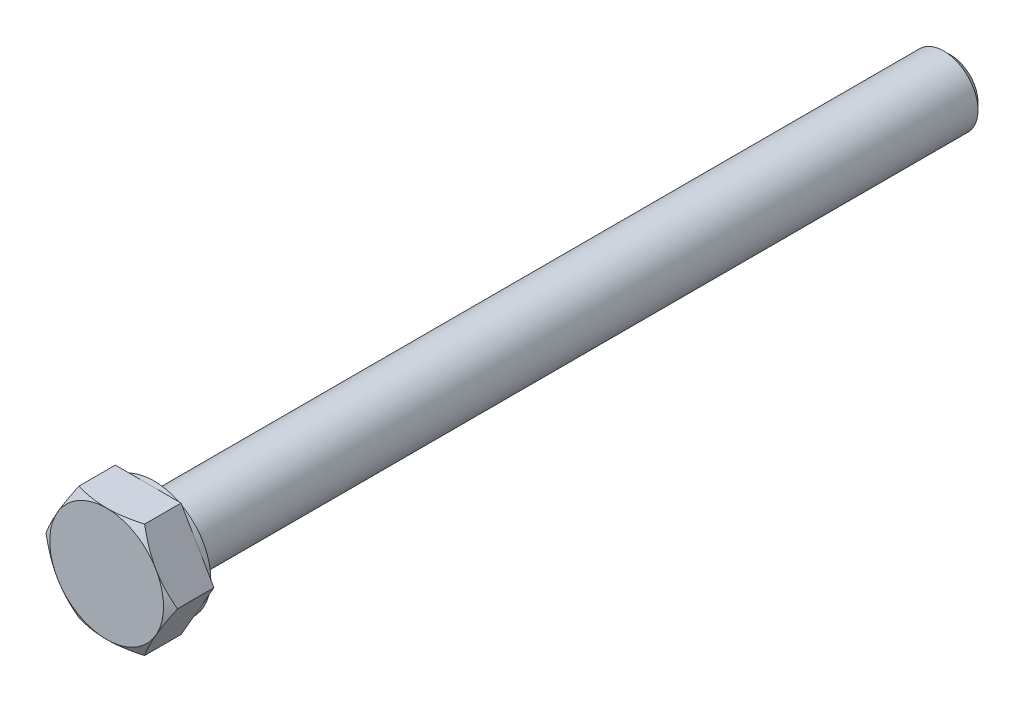
ISO-10303-21;
HEADER;
FILE_DESCRIPTION(('STEP AP214'),'2;1');
FILE_NAME('part.step','',(''),(''),'','','');
FILE_SCHEMA(('AUTOMOTIVE_DESIGN { 1 0 10303 214 1 1 1 1 }'));
ENDSEC;
DATA;
#1=APPLICATION_CONTEXT('core data for automotive mechanical design processes');
#2=APPLICATION_PROTOCOL_DEFINITION('international standard','automotive_design',2000,#1);
#3=PRODUCT_CONTEXT('',#1,'mechanical');
#4=PRODUCT('Part','Part','',(#3));
#5=PRODUCT_RELATED_PRODUCT_CATEGORY('part','',(#4));
#6=PRODUCT_DEFINITION_FORMATION('','',#4);
#7=PRODUCT_DEFINITION_CONTEXT('part definition',#1,'design');
#8=PRODUCT_DEFINITION('design','',#6,#7);
#9=PRODUCT_DEFINITION_SHAPE('','',#8);
#10=(LENGTH_UNIT() NAMED_UNIT(*) SI_UNIT(.MILLI.,.METRE.));
#11=(NAMED_UNIT(*) PLANE_ANGLE_UNIT() SI_UNIT($,.RADIAN.));
#12=(NAMED_UNIT(*) SI_UNIT($,.STERADIAN.) SOLID_ANGLE_UNIT());
#13=UNCERTAINTY_MEASURE_WITH_UNIT(LENGTH_MEASURE(1.E-05),#10,'distance_accuracy_value','');
#14=(GEOMETRIC_REPRESENTATION_CONTEXT(3) GLOBAL_UNCERTAINTY_ASSIGNED_CONTEXT((#13)) GLOBAL_UNIT_ASSIGNED_CONTEXT((#10,
#11,#12)) REPRESENTATION_CONTEXT('',''));
#15=CARTESIAN_POINT('',(0.,0.,0.));
#16=DIRECTION('',(0.,0.,1.));
#17=DIRECTION('',(1.,0.,0.));
#18=AXIS2_PLACEMENT_3D('',#15,#16,#17);
#19=CARTESIAN_POINT('',(0.,0.,4.15));
#20=DIRECTION('',(0.,0.,1.));
#21=DIRECTION('',(1.,0.,0.));
#22=AXIS2_PLACEMENT_3D('',#19,#20,#21);
#23=PLANE('',#22);
#24=CARTESIAN_POINT('',(0.,0.,4.15));
#25=DIRECTION('',(0.,0.,1.));
#26=DIRECTION('',(1.,0.,0.));
#27=AXIS2_PLACEMENT_3D('',#24,#25,#26);
#28=CIRCLE('',#27,5.);
#29=CARTESIAN_POINT('',(5.,0.,4.15));
#30=VERTEX_POINT('',#29);
#31=EDGE_CURVE('E10',#30,#30,#28,.T.);
#32=ORIENTED_EDGE('',*,*,#31,.T.);
#33=EDGE_LOOP('',(#32));
#34=FACE_BOUND('',#33,.T.);
#35=ADVANCED_FACE('F16',(#34),#23,.T.);
#36=CARTESIAN_POINT('',(0.,0.,4.15));
#37=DIRECTION('',(0.,0.,-1.));
#38=DIRECTION('',(1.,0.,0.));
#39=AXIS2_PLACEMENT_3D('',#36,#37,#38);
#40=CONICAL_SURFACE('',#39,5.,1.047197551197);
#41=CARTESIAN_POINT('',(2.8874999999992,5.00129670685568,3.70255354137743));
#42=CARTESIAN_POINT('',(4.33124999999986,2.50064835342825,4.53610299252072));
#43=CARTESIAN_POINT('',(5.77500000000043,9.62341317745086E-13,3.70255354137764));
#44=(BOUNDED_CURVE() B_SPLINE_CURVE(2,(#41,#42,#43),.UNSPECIFIED.,.F.,
.F.) B_SPLINE_CURVE_WITH_KNOTS((3,3),(0.,1.),
.UNSPECIFIED.) CURVE() GEOMETRIC_REPRESENTATION_ITEM() RATIONAL_B_SPLINE_CURVE((1.,
1.15470053837938,1.)) REPRESENTATION_ITEM(''));
#45=CARTESIAN_POINT('',(2.8875,5.001296706855,3.702553541378));
#46=VERTEX_POINT('',#45);
#47=CARTESIAN_POINT('',(5.775,0.,3.702553541378));
#48=VERTEX_POINT('',#47);
#49=EDGE_CURVE('E135',#46,#48,#44,.T.);
#50=ORIENTED_EDGE('',*,*,#49,.F.);
#51=CARTESIAN_POINT('',(-2.88750000000039,5.001296706855,3.70255354137778));
#52=CARTESIAN_POINT('',(-1.94066984704477E-13,5.00129670685504,4.53610299252048));
#53=CARTESIAN_POINT('',(2.88749999999987,5.001296706855,3.70255354137793));
#54=(BOUNDED_CURVE() B_SPLINE_CURVE(2,(#51,#52,#53),.UNSPECIFIED.,.F.,
.F.) B_SPLINE_CURVE_WITH_KNOTS((3,3),(0.,1.),
.UNSPECIFIED.) CURVE() GEOMETRIC_REPRESENTATION_ITEM() RATIONAL_B_SPLINE_CURVE((1.,
1.15470053837927,1.)) REPRESENTATION_ITEM(''));
#55=CARTESIAN_POINT('',(-2.8875,5.001296706855,3.702553541378));
#56=VERTEX_POINT('',#55);
#57=EDGE_CURVE('E155',#56,#46,#54,.T.);
#58=ORIENTED_EDGE('',*,*,#57,.F.);
#59=CARTESIAN_POINT('',(-5.7750000000016,-1.0627054791712E-12,3.70255354137697));
#60=CARTESIAN_POINT('',(-4.33125000000055,2.50064835342705,4.53610299252083));
#61=CARTESIAN_POINT('',(-2.88749999999986,5.00129670685454,3.70255354137781));
#62=(BOUNDED_CURVE() B_SPLINE_CURVE(2,(#59,#60,#61),.UNSPECIFIED.,.F.,
.F.) B_SPLINE_CURVE_WITH_KNOTS((3,3),(0.,1.),
.UNSPECIFIED.) CURVE() GEOMETRIC_REPRESENTATION_ITEM() RATIONAL_B_SPLINE_CURVE((1.,
1.15470053837943,1.)) REPRESENTATION_ITEM(''));
#63=CARTESIAN_POINT('',(-5.775,0.,3.702553541378));
#64=VERTEX_POINT('',#63);
#65=EDGE_CURVE('E161',#64,#56,#62,.T.);
#66=ORIENTED_EDGE('',*,*,#65,.F.);
#67=CARTESIAN_POINT('',(-2.8874999999992,-5.00129670685568,3.70255354137743));
#68=CARTESIAN_POINT('',(-4.33124999999987,-2.50064835342823,4.53610299252073));
#69=CARTESIAN_POINT('',(-5.77500000000045,-9.2104102122903E-13,3.70255354137763));
#70=(BOUNDED_CURVE() B_SPLINE_CURVE(2,(#67,#68,#69),.UNSPECIFIED.,.F.,
.F.) B_SPLINE_CURVE_WITH_KNOTS((3,3),(0.,1.),
.UNSPECIFIED.) CURVE() GEOMETRIC_REPRESENTATION_ITEM() RATIONAL_B_SPLINE_CURVE((1.,
1.15470053837938,1.)) REPRESENTATION_ITEM(''));
#71=CARTESIAN_POINT('',(-2.8875,-5.001296706855,3.702553541378));
#72=VERTEX_POINT('',#71);
#73=EDGE_CURVE('E176',#72,#64,#70,.T.);
#74=ORIENTED_EDGE('',*,*,#73,.F.);
#75=CARTESIAN_POINT('',(2.88750000000039,-5.001296706855,3.70255354137778));
#76=CARTESIAN_POINT('',(1.93622895494628E-13,-5.00129670685504,4.53610299252048));
#77=CARTESIAN_POINT('',(-2.88749999999987,-5.001296706855,3.70255354137793));
#78=(BOUNDED_CURVE() B_SPLINE_CURVE(2,(#75,#76,#77),.UNSPECIFIED.,.F.,
.F.) B_SPLINE_CURVE_WITH_KNOTS((3,3),(0.,1.),
.UNSPECIFIED.) CURVE() GEOMETRIC_REPRESENTATION_ITEM() RATIONAL_B_SPLINE_CURVE((1.,
1.15470053837927,1.)) REPRESENTATION_ITEM(''));
#79=CARTESIAN_POINT('',(2.8875,-5.001296706855,3.702553541378));
#80=VERTEX_POINT('',#79);
#81=EDGE_CURVE('E188',#80,#72,#78,.T.);
#82=ORIENTED_EDGE('',*,*,#81,.F.);
#83=CARTESIAN_POINT('',(5.77500000000167,1.18571819029967E-12,3.70255354137693));
#84=CARTESIAN_POINT('',(4.33125000000057,-2.50064835342701,4.53610299252084));
#85=CARTESIAN_POINT('',(2.88749999999986,-5.00129670685454,3.70255354137781));
#86=(BOUNDED_CURVE() B_SPLINE_CURVE(2,(#83,#84,#85),.UNSPECIFIED.,.F.,
.F.) B_SPLINE_CURVE_WITH_KNOTS((3,3),(0.,1.),
.UNSPECIFIED.) CURVE() GEOMETRIC_REPRESENTATION_ITEM() RATIONAL_B_SPLINE_CURVE((1.,
1.15470053837944,1.)) REPRESENTATION_ITEM(''));
#87=EDGE_CURVE('E41',#48,#80,#86,.T.);
#88=ORIENTED_EDGE('',*,*,#87,.F.);
#89=DIRECTION('',(0.866025403784329,0.,-0.50000000000019));
#90=VECTOR('',#89,1.);
#91=CARTESIAN_POINT('',(5.,0.,4.15));
#92=LINE('',#91,#90);
#93=EDGE_CURVE('E24',#30,#48,#92,.T.);
#94=ORIENTED_EDGE('',*,*,#93,.F.);
#95=ORIENTED_EDGE('',*,*,#31,.F.);
#96=ORIENTED_EDGE('',*,*,#93,.T.);
#97=EDGE_LOOP('',(#50,#58,#66,#74,#82,#88,#94,#95,#96));
#98=FACE_BOUND('',#97,.T.);
#99=ADVANCED_FACE('F207',(#98),#40,.T.);
#100=CARTESIAN_POINT('',(2.8875,-5.001296706855,0.));
#101=DIRECTION('',(-0.866025403784329,0.50000000000019,0.));
#102=DIRECTION('',(0.,0.,1.));
#103=AXIS2_PLACEMENT_3D('',#100,#101,#102);
#104=PLANE('',#103);
#105=DIRECTION('',(0.,0.,1.));
#106=VECTOR('',#105,1.);
#107=CARTESIAN_POINT('',(5.775,0.,0.5));
#108=LINE('',#107,#106);
#109=CARTESIAN_POINT('',(5.775,0.,0.5));
#110=VERTEX_POINT('',#109);
#111=EDGE_CURVE('E148',#110,#48,#108,.T.);
#112=ORIENTED_EDGE('',*,*,#111,.T.);
#113=ORIENTED_EDGE('',*,*,#87,.T.);
#114=DIRECTION('',(0.,0.,1.));
#115=VECTOR('',#114,1.);
#116=CARTESIAN_POINT('',(2.8875,-5.001296706855,0.));
#117=LINE('',#116,#115);
#118=CARTESIAN_POINT('',(2.8875,-5.001296706855,0.5));
#119=VERTEX_POINT('',#118);
#120=EDGE_CURVE('E181',#119,#80,#117,.T.);
#121=ORIENTED_EDGE('',*,*,#120,.F.);
#122=DIRECTION('',(0.50000000000019,0.866025403784329,0.));
#123=VECTOR('',#122,1.);
#124=CARTESIAN_POINT('',(3.609375,-3.750972530141,0.5));
#125=LINE('',#124,#123);
#126=EDGE_CURVE('E121',#119,#110,#125,.T.);
#127=ORIENTED_EDGE('',*,*,#126,.T.);
#128=EDGE_LOOP('',(#112,#113,#121,#127));
#129=FACE_BOUND('',#128,.T.);
#130=ADVANCED_FACE('F211',(#129),#104,.F.);
#131=CARTESIAN_POINT('',(-2.8875,-5.001296706855,0.));
#132=DIRECTION('',(0.,1.,0.));
#133=DIRECTION('',(1.,0.,0.));
#134=AXIS2_PLACEMENT_3D('',#131,#132,#133);
#135=PLANE('',#134);
#136=ORIENTED_EDGE('',*,*,#120,.T.);
#137=ORIENTED_EDGE('',*,*,#81,.T.);
#138=DIRECTION('',(0.,0.,1.));
#139=VECTOR('',#138,1.);
#140=CARTESIAN_POINT('',(-2.8875,-5.001296706855,0.));
#141=LINE('',#140,#139);
#142=CARTESIAN_POINT('',(-2.8875,-5.001296706855,0.5));
#143=VERTEX_POINT('',#142);
#144=EDGE_CURVE('E169',#143,#72,#141,.T.);
#145=ORIENTED_EDGE('',*,*,#144,.F.);
#146=DIRECTION('',(1.,0.,0.));
#147=VECTOR('',#146,1.);
#148=CARTESIAN_POINT('',(-1.44375,-5.001296706855,0.5));
#149=LINE('',#148,#147);
#150=EDGE_CURVE('E130',#143,#119,#149,.T.);
#151=ORIENTED_EDGE('',*,*,#150,.T.);
#152=EDGE_LOOP('',(#136,#137,#145,#151));
#153=FACE_BOUND('',#152,.T.);
#154=ADVANCED_FACE('F275',(#153),#135,.F.);
#155=CARTESIAN_POINT('',(-5.775,0.,0.));
#156=DIRECTION('',(0.866025403784329,0.50000000000019,0.));
#157=DIRECTION('',(0.,0.,-1.));
#158=AXIS2_PLACEMENT_3D('',#155,#156,#157);
#159=PLANE('',#158);
#160=ORIENTED_EDGE('',*,*,#144,.T.);
#161=ORIENTED_EDGE('',*,*,#73,.T.);
#162=DIRECTION('',(0.,0.,1.));
#163=VECTOR('',#162,1.);
#164=CARTESIAN_POINT('',(-5.775,0.,0.));
#165=LINE('',#164,#163);
#166=CARTESIAN_POINT('',(-5.775,0.,0.5));
#167=VERTEX_POINT('',#166);
#168=EDGE_CURVE('E160',#167,#64,#165,.T.);
#169=ORIENTED_EDGE('',*,*,#168,.F.);
#170=DIRECTION('',(0.50000000000019,-0.866025403784329,0.));
#171=VECTOR('',#170,1.);
#172=CARTESIAN_POINT('',(-5.053125,-1.250324176714,0.5));
#173=LINE('',#172,#171);
#174=EDGE_CURVE('E140',#167,#143,#173,.T.);
#175=ORIENTED_EDGE('',*,*,#174,.T.);
#176=EDGE_LOOP('',(#160,#161,#169,#175));
#177=FACE_BOUND('',#176,.T.);
#178=ADVANCED_FACE('F284',(#177),#159,.F.);
#179=CARTESIAN_POINT('',(-2.8875,5.001296706855,0.));
#180=DIRECTION('',(0.866025403784329,-0.50000000000019,0.));
#181=DIRECTION('',(0.,0.,-1.));
#182=AXIS2_PLACEMENT_3D('',#179,#180,#181);
#183=PLANE('',#182);
#184=ORIENTED_EDGE('',*,*,#168,.T.);
#185=ORIENTED_EDGE('',*,*,#65,.T.);
#186=DIRECTION('',(0.,0.,1.));
#187=VECTOR('',#186,1.);
#188=CARTESIAN_POINT('',(-2.8875,5.001296706855,0.));
#189=LINE('',#188,#187);
#190=CARTESIAN_POINT('',(-2.8875,5.001296706855,0.5));
#191=VERTEX_POINT('',#190);
#192=EDGE_CURVE('E151',#191,#56,#189,.T.);
#193=ORIENTED_EDGE('',*,*,#192,.F.);
#194=DIRECTION('',(-0.50000000000019,-0.866025403784329,0.));
#195=VECTOR('',#194,1.);
#196=CARTESIAN_POINT('',(-3.609375,3.750972530141,0.5));
#197=LINE('',#196,#195);
#198=EDGE_CURVE('E144',#191,#167,#197,.T.);
#199=ORIENTED_EDGE('',*,*,#198,.T.);
#200=EDGE_LOOP('',(#184,#185,#193,#199));
#201=FACE_BOUND('',#200,.T.);
#202=ADVANCED_FACE('F287',(#201),#183,.F.);
#203=CARTESIAN_POINT('',(2.8875,5.001296706855,0.));
#204=DIRECTION('',(0.,-1.,0.));
#205=DIRECTION('',(-1.,0.,0.));
#206=AXIS2_PLACEMENT_3D('',#203,#204,#205);
#207=PLANE('',#206);
#208=ORIENTED_EDGE('',*,*,#192,.T.);
#209=ORIENTED_EDGE('',*,*,#57,.T.);
#210=DIRECTION('',(0.,0.,1.));
#211=VECTOR('',#210,1.);
#212=CARTESIAN_POINT('',(2.8875,5.001296706855,0.));
#213=LINE('',#212,#211);
#214=CARTESIAN_POINT('',(2.8875,5.001296706855,0.5));
#215=VERTEX_POINT('',#214);
#216=EDGE_CURVE('E131',#215,#46,#213,.T.);
#217=ORIENTED_EDGE('',*,*,#216,.F.);
#218=DIRECTION('',(-1.,0.,0.));
#219=VECTOR('',#218,1.);
#220=CARTESIAN_POINT('',(1.44375,5.001296706855,0.5));
#221=LINE('',#220,#219);
#222=EDGE_CURVE('E136',#215,#191,#221,.T.);
#223=ORIENTED_EDGE('',*,*,#222,.T.);
#224=EDGE_LOOP('',(#208,#209,#217,#223));
#225=FACE_BOUND('',#224,.T.);
#226=ADVANCED_FACE('F281',(#225),#207,.F.);
#227=CARTESIAN_POINT('',(5.775,0.,0.));
#228=DIRECTION('',(-0.866025403784329,-0.50000000000019,0.));
#229=DIRECTION('',(-0.50000000000019,0.866025403784329,0.));
#230=AXIS2_PLACEMENT_3D('',#227,#228,#229);
#231=PLANE('',#230);
#232=ORIENTED_EDGE('',*,*,#216,.T.);
#233=ORIENTED_EDGE('',*,*,#49,.T.);
#234=ORIENTED_EDGE('',*,*,#111,.F.);
#235=DIRECTION('',(-0.50000000000019,0.866025403784329,0.));
#236=VECTOR('',#235,1.);
#237=CARTESIAN_POINT('',(5.053125,1.250324176714,0.5));
#238=LINE('',#237,#236);
#239=EDGE_CURVE('E114',#110,#215,#238,.T.);
#240=ORIENTED_EDGE('',*,*,#239,.T.);
#241=EDGE_LOOP('',(#232,#233,#234,#240));
#242=FACE_BOUND('',#241,.T.);
#243=ADVANCED_FACE('F215',(#242),#231,.F.);
#244=CARTESIAN_POINT('',(0.,0.,0.5));
#245=DIRECTION('',(0.,0.,1.));
#246=DIRECTION('',(1.,0.,0.));
#247=AXIS2_PLACEMENT_3D('',#244,#245,#246);
#248=PLANE('',#247);
#249=CARTESIAN_POINT('',(0.,0.,0.5));
#250=DIRECTION('',(0.,0.,1.));
#251=DIRECTION('',(1.,0.,0.));
#252=AXIS2_PLACEMENT_3D('',#249,#250,#251);
#253=CIRCLE('',#252,5.);
#254=CARTESIAN_POINT('',(5.,0.,0.5));
#255=VERTEX_POINT('',#254);
#256=EDGE_CURVE('E108',#255,#255,#253,.T.);
#257=ORIENTED_EDGE('',*,*,#256,.T.);
#258=EDGE_LOOP('',(#257));
#259=FACE_BOUND('',#258,.T.);
#260=ORIENTED_EDGE('',*,*,#239,.F.);
#261=ORIENTED_EDGE('',*,*,#126,.F.);
#262=ORIENTED_EDGE('',*,*,#150,.F.);
#263=ORIENTED_EDGE('',*,*,#174,.F.);
#264=ORIENTED_EDGE('',*,*,#198,.F.);
#265=ORIENTED_EDGE('',*,*,#222,.F.);
#266=EDGE_LOOP('',(#260,#261,#262,#263,#264,#265));
#267=FACE_BOUND('',#266,.T.);
#268=ADVANCED_FACE('F109',(#259,#267),#248,.F.);
#269=CARTESIAN_POINT('',(0.,0.,0.));
#270=DIRECTION('',(0.,0.,1.));
#271=DIRECTION('',(1.,0.,0.));
#272=AXIS2_PLACEMENT_3D('',#269,#270,#271);
#273=CYLINDRICAL_SURFACE('',#272,5.);
#274=CARTESIAN_POINT('',(0.,0.,0.));
#275=DIRECTION('',(0.,0.,1.));
#276=DIRECTION('',(1.,0.,0.));
#277=AXIS2_PLACEMENT_3D('',#274,#275,#276);
#278=CIRCLE('',#277,5.);
#279=CARTESIAN_POINT('',(5.,0.,0.));
#280=VERTEX_POINT('',#279);
#281=EDGE_CURVE('E123',#280,#280,#278,.T.);
#282=ORIENTED_EDGE('',*,*,#281,.T.);
#283=DIRECTION('',(0.,0.,1.));
#284=VECTOR('',#283,1.);
#285=CARTESIAN_POINT('',(5.,0.,0.));
#286=LINE('',#285,#284);
#287=EDGE_CURVE('E115',#280,#255,#286,.T.);
#288=ORIENTED_EDGE('',*,*,#287,.T.);
#289=ORIENTED_EDGE('',*,*,#256,.F.);
#290=ORIENTED_EDGE('',*,*,#287,.F.);
#291=EDGE_LOOP('',(#282,#288,#289,#290));
#292=FACE_BOUND('',#291,.T.);
#293=ADVANCED_FACE('F306',(#292),#273,.T.);
#294=CARTESIAN_POINT('',(0.,0.,0.));
#295=DIRECTION('',(0.,0.,1.));
#296=DIRECTION('',(1.,0.,0.));
#297=AXIS2_PLACEMENT_3D('',#294,#295,#296);
#298=PLANE('',#297);
#299=ORIENTED_EDGE('',*,*,#281,.F.);
#300=EDGE_LOOP('',(#299));
#301=FACE_BOUND('',#300,.T.);
#302=CARTESIAN_POINT('',(0.,0.,0.));
#303=DIRECTION('',(0.,0.,1.));
#304=DIRECTION('',(1.,0.,0.));
#305=AXIS2_PLACEMENT_3D('',#302,#303,#304);
#306=CIRCLE('',#305,3.);
#307=CARTESIAN_POINT('',(3.,0.,0.));
#308=VERTEX_POINT('',#307);
#309=EDGE_CURVE('E230',#308,#308,#306,.T.);
#310=ORIENTED_EDGE('',*,*,#309,.T.);
#311=EDGE_LOOP('',(#310));
#312=FACE_BOUND('',#311,.T.);
#313=ADVANCED_FACE('F310',(#301,#312),#298,.F.);
#314=CARTESIAN_POINT('',(0.,0.,-69.40000000005));
#315=DIRECTION('',(0.,0.,1.));
#316=DIRECTION('',(1.,0.,0.));
#317=AXIS2_PLACEMENT_3D('',#314,#315,#316);
#318=CYLINDRICAL_SURFACE('',#317,3.);
#319=CARTESIAN_POINT('',(0.,0.,-69.40000000005));
#320=DIRECTION('',(0.,0.,1.));
#321=DIRECTION('',(1.,0.,0.));
#322=AXIS2_PLACEMENT_3D('',#319,#320,#321);
#323=CIRCLE('',#322,3.);
#324=CARTESIAN_POINT('',(3.,0.,-69.40000000005));
#325=VERTEX_POINT('',#324);
#326=EDGE_CURVE('E242',#325,#325,#323,.T.);
#327=ORIENTED_EDGE('',*,*,#326,.T.);
#328=DIRECTION('',(0.,0.,1.));
#329=VECTOR('',#328,1.);
#330=CARTESIAN_POINT('',(3.,0.,-69.40000000005));
#331=LINE('',#330,#329);
#332=EDGE_CURVE('E245',#325,#308,#331,.T.);
#333=ORIENTED_EDGE('',*,*,#332,.T.);
#334=ORIENTED_EDGE('',*,*,#309,.F.);
#335=ORIENTED_EDGE('',*,*,#332,.F.);
#336=EDGE_LOOP('',(#327,#333,#334,#335));
#337=FACE_BOUND('',#336,.T.);
#338=ADVANCED_FACE('F253',(#337),#318,.T.);
#339=CARTESIAN_POINT('',(0.,0.,-70.));
#340=DIRECTION('',(0.,0.,1.));
#341=DIRECTION('',(1.,0.,0.));
#342=AXIS2_PLACEMENT_3D('',#339,#340,#341);
#343=CONICAL_SURFACE('',#342,2.4,0.785398163444);
#344=CARTESIAN_POINT('',(0.,0.,-70.));
#345=DIRECTION('',(0.,0.,1.));
#346=DIRECTION('',(1.,0.,0.));
#347=AXIS2_PLACEMENT_3D('',#344,#345,#346);
#348=CIRCLE('',#347,2.4);
#349=CARTESIAN_POINT('',(2.4,0.,-70.));
#350=VERTEX_POINT('',#349);
#351=EDGE_CURVE('E231',#350,#350,#348,.T.);
#352=ORIENTED_EDGE('',*,*,#351,.T.);
#353=DIRECTION('',(0.707106781219048,0.,0.707106781154048));
#354=VECTOR('',#353,1.);
#355=CARTESIAN_POINT('',(2.4,0.,-70.));
#356=LINE('',#355,#354);
#357=EDGE_CURVE('E235',#350,#325,#356,.T.);
#358=ORIENTED_EDGE('',*,*,#357,.T.);
#359=ORIENTED_EDGE('',*,*,#326,.F.);
#360=ORIENTED_EDGE('',*,*,#357,.F.);
#361=EDGE_LOOP('',(#352,#358,#359,#360));
#362=FACE_BOUND('',#361,.T.);
#363=ADVANCED_FACE('F256',(#362),#343,.T.);
#364=CARTESIAN_POINT('',(0.,0.,-70.));
#365=DIRECTION('',(0.,0.,1.));
#366=DIRECTION('',(1.,0.,0.));
#367=AXIS2_PLACEMENT_3D('',#364,#365,#366);
#368=PLANE('',#367);
#369=ORIENTED_EDGE('',*,*,#351,.F.);
#370=EDGE_LOOP('',(#369));
#371=FACE_BOUND('',#370,.T.);
#372=ADVANCED_FACE('F259',(#371),#368,.F.);
#373=CLOSED_SHELL('',(#35,#99,#130,#154,#178,#202,#226,#243,#268,#293,#313,#338,#363,#372));
#374=MANIFOLD_SOLID_BREP('B1',#373);
#375=ADVANCED_BREP_SHAPE_REPRESENTATION('',(#18,#374),#14);
#376=SHAPE_DEFINITION_REPRESENTATION(#9,#375);
ENDSEC;
END-ISO-10303-21;
